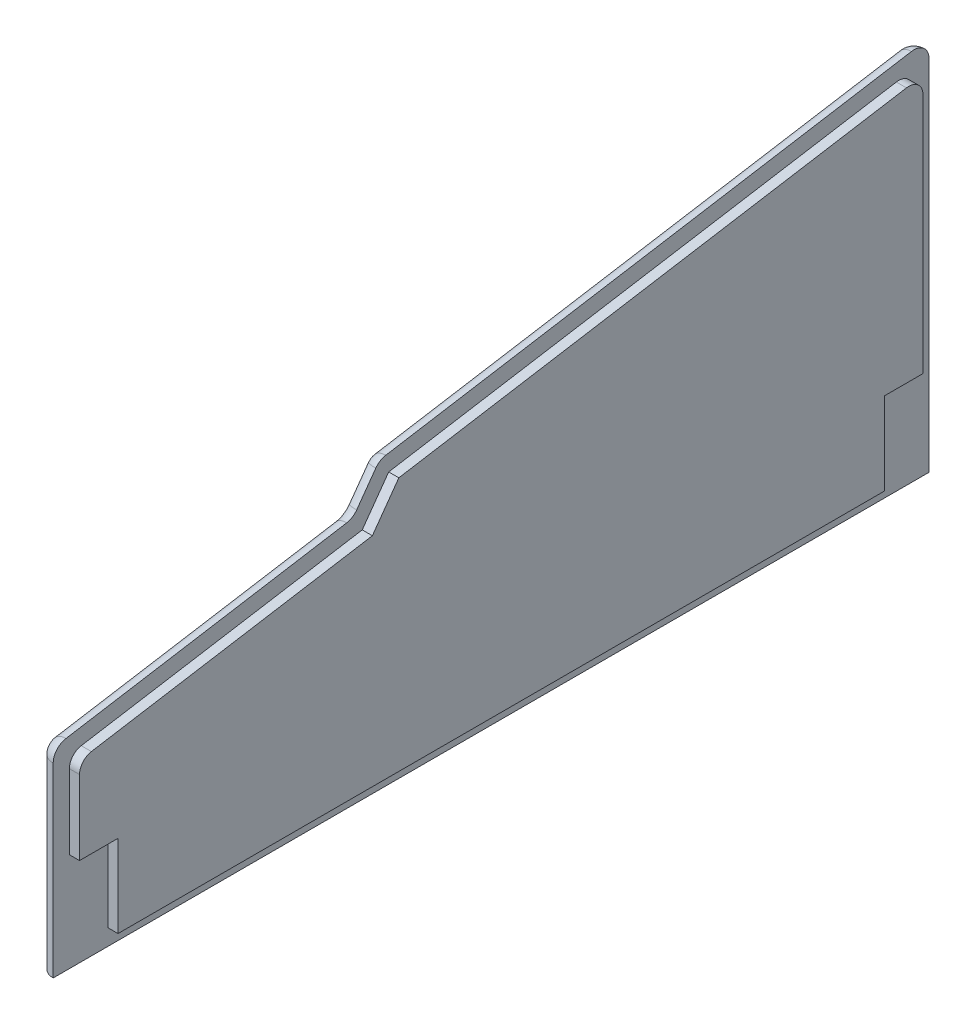
ISO-10303-21;
HEADER;
FILE_DESCRIPTION(('STEP AP214'),'2;1');
FILE_NAME('part.step','',(''),(''),'','','');
FILE_SCHEMA(('AUTOMOTIVE_DESIGN { 1 0 10303 214 1 1 1 1 }'));
ENDSEC;
DATA;
#1=APPLICATION_CONTEXT('core data for automotive mechanical design processes');
#2=APPLICATION_PROTOCOL_DEFINITION('international standard','automotive_design',2000,#1);
#3=PRODUCT_CONTEXT('',#1,'mechanical');
#4=PRODUCT('Part','Part','',(#3));
#5=PRODUCT_RELATED_PRODUCT_CATEGORY('part','',(#4));
#6=PRODUCT_DEFINITION_FORMATION('','',#4);
#7=PRODUCT_DEFINITION_CONTEXT('part definition',#1,'design');
#8=PRODUCT_DEFINITION('design','',#6,#7);
#9=PRODUCT_DEFINITION_SHAPE('','',#8);
#10=(LENGTH_UNIT() NAMED_UNIT(*) SI_UNIT(.MILLI.,.METRE.));
#11=(NAMED_UNIT(*) PLANE_ANGLE_UNIT() SI_UNIT($,.RADIAN.));
#12=(NAMED_UNIT(*) SI_UNIT($,.STERADIAN.) SOLID_ANGLE_UNIT());
#13=UNCERTAINTY_MEASURE_WITH_UNIT(LENGTH_MEASURE(1.E-05),#10,'distance_accuracy_value','');
#14=(GEOMETRIC_REPRESENTATION_CONTEXT(3) GLOBAL_UNCERTAINTY_ASSIGNED_CONTEXT((#13)) GLOBAL_UNIT_ASSIGNED_CONTEXT((#10,
#11,#12)) REPRESENTATION_CONTEXT('',''));
#15=CARTESIAN_POINT('',(0.,0.,0.));
#16=DIRECTION('',(0.,0.,1.));
#17=DIRECTION('',(1.,0.,0.));
#18=AXIS2_PLACEMENT_3D('',#15,#16,#17);
#19=CARTESIAN_POINT('',(-327.974562358316,0.,137.10500183886));
#20=DIRECTION('',(0.,0.,-1.));
#21=DIRECTION('',(-1.,0.,0.));
#22=AXIS2_PLACEMENT_3D('',#19,#20,#21);
#23=PLANE('',#22);
#24=DIRECTION('',(0.,-1.,0.));
#25=VECTOR('',#24,1.);
#26=CARTESIAN_POINT('',(-329.974562358316,0.,137.10500183886));
#27=LINE('',#26,#25);
#28=CARTESIAN_POINT('',(-329.974562358316,14.690261728625,137.10500183886));
#29=VERTEX_POINT('',#28);
#30=CARTESIAN_POINT('',(-329.974562358316,-0.0195091277780118,137.10500183886));
#31=VERTEX_POINT('',#30);
#32=EDGE_CURVE('E292',#29,#31,#27,.T.);
#33=ORIENTED_EDGE('',*,*,#32,.T.);
#34=DIRECTION('',(-1.,0.,0.));
#35=VECTOR('',#34,1.);
#36=CARTESIAN_POINT('',(-327.974562358316,-0.0195091277780118,137.10500183886));
#37=LINE('',#36,#35);
#38=CARTESIAN_POINT('',(-327.974562358316,-0.0195091277780118,137.10500183886));
#39=VERTEX_POINT('',#38);
#40=EDGE_CURVE('E232',#39,#31,#37,.T.);
#41=ORIENTED_EDGE('',*,*,#40,.F.);
#42=DIRECTION('',(0.,-1.,0.));
#43=VECTOR('',#42,1.);
#44=CARTESIAN_POINT('',(-327.974562358316,0.,137.10500183886));
#45=LINE('',#44,#43);
#46=CARTESIAN_POINT('',(-327.974562358316,14.690261728625,137.10500183886));
#47=VERTEX_POINT('',#46);
#48=EDGE_CURVE('E264',#47,#39,#45,.T.);
#49=ORIENTED_EDGE('',*,*,#48,.F.);
#50=DIRECTION('',(-1.,0.,0.));
#51=VECTOR('',#50,1.);
#52=CARTESIAN_POINT('',(-327.974562358316,14.690261728625,137.10500183886));
#53=LINE('',#52,#51);
#54=EDGE_CURVE('E233',#47,#29,#53,.T.);
#55=ORIENTED_EDGE('',*,*,#54,.T.);
#56=EDGE_LOOP('',(#33,#41,#49,#55));
#57=FACE_BOUND('',#56,.T.);
#58=ADVANCED_FACE('F40',(#57),#23,.F.);
#59=CARTESIAN_POINT('',(-327.974562358316,-0.0195091277779954,0.));
#60=DIRECTION('',(0.,-1.,0.));
#61=DIRECTION('',(0.,0.,-1.));
#62=AXIS2_PLACEMENT_3D('',#59,#60,#61);
#63=PLANE('',#62);
#64=DIRECTION('',(0.,0.,1.));
#65=VECTOR('',#64,1.);
#66=CARTESIAN_POINT('',(-329.974562358316,-0.0195091277779954,0.));
#67=LINE('',#66,#65);
#68=CARTESIAN_POINT('',(-329.974562358316,-0.0195091277780113,129.50500183886));
#69=VERTEX_POINT('',#68);
#70=EDGE_CURVE('E261',#69,#31,#67,.T.);
#71=ORIENTED_EDGE('',*,*,#70,.F.);
#72=DIRECTION('',(-1.,0.,0.));
#73=VECTOR('',#72,1.);
#74=CARTESIAN_POINT('',(-327.974562358316,-0.0195091277780113,129.50500183886));
#75=LINE('',#74,#73);
#76=CARTESIAN_POINT('',(-327.974562358316,-0.0195091277780113,129.50500183886));
#77=VERTEX_POINT('',#76);
#78=EDGE_CURVE('E257',#77,#69,#75,.T.);
#79=ORIENTED_EDGE('',*,*,#78,.F.);
#80=DIRECTION('',(0.,0.,1.));
#81=VECTOR('',#80,1.);
#82=CARTESIAN_POINT('',(-327.974562358316,-0.0195091277779954,0.));
#83=LINE('',#82,#81);
#84=EDGE_CURVE('E236',#77,#39,#83,.T.);
#85=ORIENTED_EDGE('',*,*,#84,.T.);
#86=ORIENTED_EDGE('',*,*,#40,.T.);
#87=EDGE_LOOP('',(#71,#79,#85,#86));
#88=FACE_BOUND('',#87,.T.);
#89=ADVANCED_FACE('F376',(#88),#63,.T.);
#90=CARTESIAN_POINT('',(-327.974562358316,2.20756218874649E-13,129.50500183886));
#91=DIRECTION('',(0.,0.,1.));
#92=DIRECTION('',(0.,-1.,0.));
#93=AXIS2_PLACEMENT_3D('',#90,#91,#92);
#94=PLANE('',#93);
#95=DIRECTION('',(0.,1.,0.));
#96=VECTOR('',#95,1.);
#97=CARTESIAN_POINT('',(-329.974562358316,2.20756218874649E-13,129.50500183886));
#98=LINE('',#97,#96);
#99=CARTESIAN_POINT('',(-329.974562358316,-16.3021121251671,129.50500183886));
#100=VERTEX_POINT('',#99);
#101=EDGE_CURVE('E265',#100,#69,#98,.T.);
#102=ORIENTED_EDGE('',*,*,#101,.F.);
#103=DIRECTION('',(-1.,0.,0.));
#104=VECTOR('',#103,1.);
#105=CARTESIAN_POINT('',(-327.974562358316,-16.3021121251671,129.50500183886));
#106=LINE('',#105,#104);
#107=CARTESIAN_POINT('',(-327.974562358316,-16.3021121251671,129.50500183886));
#108=VERTEX_POINT('',#107);
#109=EDGE_CURVE('E255',#108,#100,#106,.T.);
#110=ORIENTED_EDGE('',*,*,#109,.F.);
#111=DIRECTION('',(0.,1.,0.));
#112=VECTOR('',#111,1.);
#113=CARTESIAN_POINT('',(-327.974562358316,2.20756218874649E-13,129.50500183886));
#114=LINE('',#113,#112);
#115=EDGE_CURVE('E297',#108,#77,#114,.T.);
#116=ORIENTED_EDGE('',*,*,#115,.T.);
#117=ORIENTED_EDGE('',*,*,#78,.T.);
#118=EDGE_LOOP('',(#102,#110,#116,#117));
#119=FACE_BOUND('',#118,.T.);
#120=ADVANCED_FACE('F382',(#119),#94,.T.);
#121=CARTESIAN_POINT('',(-327.974562358316,-16.3021121251671,0.));
#122=DIRECTION('',(0.,-1.,0.));
#123=DIRECTION('',(0.,0.,-1.));
#124=AXIS2_PLACEMENT_3D('',#121,#122,#123);
#125=PLANE('',#124);
#126=DIRECTION('',(0.,0.,1.));
#127=VECTOR('',#126,1.);
#128=CARTESIAN_POINT('',(-329.974562358316,-16.3021121251671,0.));
#129=LINE('',#128,#127);
#130=CARTESIAN_POINT('',(-329.974562358316,-16.3021121251671,-21.8489705992885));
#131=VERTEX_POINT('',#130);
#132=EDGE_CURVE('E268',#131,#100,#129,.T.);
#133=ORIENTED_EDGE('',*,*,#132,.F.);
#134=DIRECTION('',(-1.,0.,0.));
#135=VECTOR('',#134,1.);
#136=CARTESIAN_POINT('',(-327.974562358316,-16.3021121251671,-21.8489705992885));
#137=LINE('',#136,#135);
#138=CARTESIAN_POINT('',(-327.974562358316,-16.3021121251671,-21.8489705992885));
#139=VERTEX_POINT('',#138);
#140=EDGE_CURVE('E253',#139,#131,#137,.T.);
#141=ORIENTED_EDGE('',*,*,#140,.F.);
#142=DIRECTION('',(0.,0.,1.));
#143=VECTOR('',#142,1.);
#144=CARTESIAN_POINT('',(-327.974562358316,-16.3021121251671,0.));
#145=LINE('',#144,#143);
#146=EDGE_CURVE('E300',#139,#108,#145,.T.);
#147=ORIENTED_EDGE('',*,*,#146,.T.);
#148=ORIENTED_EDGE('',*,*,#109,.T.);
#149=EDGE_LOOP('',(#133,#141,#147,#148));
#150=FACE_BOUND('',#149,.T.);
#151=ADVANCED_FACE('F555',(#150),#125,.T.);
#152=CARTESIAN_POINT('',(-327.974562358316,0.,-21.8489705992885));
#153=DIRECTION('',(0.,0.,-1.));
#154=DIRECTION('',(-1.,0.,0.));
#155=AXIS2_PLACEMENT_3D('',#152,#153,#154);
#156=PLANE('',#155);
#157=DIRECTION('',(0.,-1.,0.));
#158=VECTOR('',#157,1.);
#159=CARTESIAN_POINT('',(-329.974562358316,0.,-21.8489705992885));
#160=LINE('',#159,#158);
#161=CARTESIAN_POINT('',(-329.974562358316,-0.0195091277780118,-21.8489705992885));
#162=VERTEX_POINT('',#161);
#163=EDGE_CURVE('E271',#162,#131,#160,.T.);
#164=ORIENTED_EDGE('',*,*,#163,.F.);
#165=DIRECTION('',(-1.,0.,0.));
#166=VECTOR('',#165,1.);
#167=CARTESIAN_POINT('',(-327.974562358316,-0.0195091277780118,-21.8489705992885));
#168=LINE('',#167,#166);
#169=CARTESIAN_POINT('',(-327.974562358316,-0.0195091277780118,-21.8489705992885));
#170=VERTEX_POINT('',#169);
#171=EDGE_CURVE('E251',#170,#162,#168,.T.);
#172=ORIENTED_EDGE('',*,*,#171,.F.);
#173=DIRECTION('',(0.,-1.,0.));
#174=VECTOR('',#173,1.);
#175=CARTESIAN_POINT('',(-327.974562358316,0.,-21.8489705992885));
#176=LINE('',#175,#174);
#177=EDGE_CURVE('E303',#170,#139,#176,.T.);
#178=ORIENTED_EDGE('',*,*,#177,.T.);
#179=ORIENTED_EDGE('',*,*,#140,.T.);
#180=EDGE_LOOP('',(#164,#172,#178,#179));
#181=FACE_BOUND('',#180,.T.);
#182=ADVANCED_FACE('F544',(#181),#156,.T.);
#183=CARTESIAN_POINT('',(-327.974562358316,-0.0195091277780118,0.));
#184=DIRECTION('',(0.,1.,0.));
#185=DIRECTION('',(0.,0.,1.));
#186=AXIS2_PLACEMENT_3D('',#183,#184,#185);
#187=PLANE('',#186);
#188=DIRECTION('',(0.,0.,-1.));
#189=VECTOR('',#188,1.);
#190=CARTESIAN_POINT('',(-329.974562358316,-0.0195091277780118,0.));
#191=LINE('',#190,#189);
#192=CARTESIAN_POINT('',(-329.974562358316,-0.0195091277780118,-29.4489705992885));
#193=VERTEX_POINT('',#192);
#194=EDGE_CURVE('E274',#162,#193,#191,.T.);
#195=ORIENTED_EDGE('',*,*,#194,.T.);
#196=DIRECTION('',(-1.,0.,0.));
#197=VECTOR('',#196,1.);
#198=CARTESIAN_POINT('',(-327.974562358316,-0.0195091277780118,-29.4489705992885));
#199=LINE('',#198,#197);
#200=CARTESIAN_POINT('',(-327.974562358316,-0.0195091277780118,-29.4489705992885));
#201=VERTEX_POINT('',#200);
#202=EDGE_CURVE('E248',#201,#193,#199,.T.);
#203=ORIENTED_EDGE('',*,*,#202,.F.);
#204=DIRECTION('',(0.,0.,-1.));
#205=VECTOR('',#204,1.);
#206=CARTESIAN_POINT('',(-327.974562358316,-0.0195091277780118,0.));
#207=LINE('',#206,#205);
#208=EDGE_CURVE('E306',#170,#201,#207,.T.);
#209=ORIENTED_EDGE('',*,*,#208,.F.);
#210=ORIENTED_EDGE('',*,*,#171,.T.);
#211=EDGE_LOOP('',(#195,#203,#209,#210));
#212=FACE_BOUND('',#211,.T.);
#213=ADVANCED_FACE('F534',(#212),#187,.F.);
#214=CARTESIAN_POINT('',(-327.974562358316,0.,-29.4489705992885));
#215=DIRECTION('',(0.,0.,1.));
#216=DIRECTION('',(1.,0.,0.));
#217=AXIS2_PLACEMENT_3D('',#214,#215,#216);
#218=PLANE('',#217);
#219=DIRECTION('',(0.,1.,0.));
#220=VECTOR('',#219,1.);
#221=CARTESIAN_POINT('',(-329.974562358316,0.,-29.4489705992885));
#222=LINE('',#221,#220);
#223=CARTESIAN_POINT('',(-329.974562358316,47.708117707001,-29.4489705992885));
#224=VERTEX_POINT('',#223);
#225=EDGE_CURVE('E276',#193,#224,#222,.T.);
#226=ORIENTED_EDGE('',*,*,#225,.T.);
#227=DIRECTION('',(-1.,0.,0.));
#228=VECTOR('',#227,1.);
#229=CARTESIAN_POINT('',(-327.974562358316,47.708117707001,-29.4489705992885));
#230=LINE('',#229,#228);
#231=CARTESIAN_POINT('',(-327.974562358316,47.708117707001,-29.4489705992885));
#232=VERTEX_POINT('',#231);
#233=EDGE_CURVE('E246',#232,#224,#230,.T.);
#234=ORIENTED_EDGE('',*,*,#233,.F.);
#235=DIRECTION('',(0.,1.,0.));
#236=VECTOR('',#235,1.);
#237=CARTESIAN_POINT('',(-327.974562358316,0.,-29.4489705992885));
#238=LINE('',#237,#236);
#239=EDGE_CURVE('E308',#201,#232,#238,.T.);
#240=ORIENTED_EDGE('',*,*,#239,.F.);
#241=ORIENTED_EDGE('',*,*,#202,.T.);
#242=EDGE_LOOP('',(#226,#234,#240,#241));
#243=FACE_BOUND('',#242,.T.);
#244=ADVANCED_FACE('F524',(#243),#218,.F.);
#245=CARTESIAN_POINT('',(-327.974562358316,47.708117707001,-26.6489705992885));
#246=DIRECTION('',(-1.,0.,0.));
#247=DIRECTION('',(0.,0.,1.));
#248=AXIS2_PLACEMENT_3D('',#245,#246,#247);
#249=CYLINDRICAL_SURFACE('',#248,2.8);
#250=CARTESIAN_POINT('',(-329.974562358316,47.708117707001,-26.6489705992885));
#251=DIRECTION('',(-1.,0.,0.));
#252=DIRECTION('',(0.,0.,1.));
#253=AXIS2_PLACEMENT_3D('',#250,#251,#252);
#254=CIRCLE('',#253,2.8);
#255=CARTESIAN_POINT('',(-329.974562358316,50.4706843968319,-26.1926535119064));
#256=VERTEX_POINT('',#255);
#257=EDGE_CURVE('E279',#256,#224,#254,.T.);
#258=ORIENTED_EDGE('',*,*,#257,.F.);
#259=DIRECTION('',(-1.,0.,0.));
#260=VECTOR('',#259,1.);
#261=CARTESIAN_POINT('',(-327.974562358316,50.4706843968319,-26.1926535119064));
#262=LINE('',#261,#260);
#263=CARTESIAN_POINT('',(-327.974562358316,50.4706843968319,-26.1926535119064));
#264=VERTEX_POINT('',#263);
#265=EDGE_CURVE('E244',#264,#256,#262,.T.);
#266=ORIENTED_EDGE('',*,*,#265,.F.);
#267=CARTESIAN_POINT('',(-327.974562358316,47.708117707001,-26.6489705992885));
#268=DIRECTION('',(-1.,0.,0.));
#269=DIRECTION('',(0.,0.,1.));
#270=AXIS2_PLACEMENT_3D('',#267,#268,#269);
#271=CIRCLE('',#270,2.8);
#272=EDGE_CURVE('E310',#264,#232,#271,.T.);
#273=ORIENTED_EDGE('',*,*,#272,.T.);
#274=ORIENTED_EDGE('',*,*,#233,.T.);
#275=EDGE_LOOP('',(#258,#266,#273,#274));
#276=FACE_BOUND('',#275,.T.);
#277=ADVANCED_FACE('F514',(#276),#249,.T.);
#278=CARTESIAN_POINT('',(-327.974562358316,44.9186564788282,7.41960386657439));
#279=DIRECTION('',(0.,-0.98663096065388,-0.162970388350771));
#280=DIRECTION('',(0.,0.162970388350771,-0.98663096065388));
#281=AXIS2_PLACEMENT_3D('',#278,#279,#280);
#282=PLANE('',#281);
#283=DIRECTION('',(0.,-0.162970388350771,0.98663096065388));
#284=VECTOR('',#283,1.);
#285=CARTESIAN_POINT('',(-329.974562358316,44.9186564788282,7.41960386657439));
#286=LINE('',#285,#284);
#287=CARTESIAN_POINT('',(-329.974562358316,33.912543623929,74.0511668700437));
#288=VERTEX_POINT('',#287);
#289=EDGE_CURVE('E282',#256,#288,#286,.T.);
#290=ORIENTED_EDGE('',*,*,#289,.T.);
#291=DIRECTION('',(-1.,0.,0.));
#292=VECTOR('',#291,1.);
#293=CARTESIAN_POINT('',(-327.974562358316,33.912543623929,74.0511668700437));
#294=LINE('',#293,#292);
#295=CARTESIAN_POINT('',(-327.974562358316,33.912543623929,74.0511668700437));
#296=VERTEX_POINT('',#295);
#297=EDGE_CURVE('E241',#296,#288,#294,.T.);
#298=ORIENTED_EDGE('',*,*,#297,.F.);
#299=DIRECTION('',(0.,-0.162970388350771,0.98663096065388));
#300=VECTOR('',#299,1.);
#301=CARTESIAN_POINT('',(-327.974562358316,44.9186564788282,7.41960386657439));
#302=LINE('',#301,#300);
#303=EDGE_CURVE('E313',#264,#296,#302,.T.);
#304=ORIENTED_EDGE('',*,*,#303,.F.);
#305=ORIENTED_EDGE('',*,*,#265,.T.);
#306=EDGE_LOOP('',(#290,#298,#304,#305));
#307=FACE_BOUND('',#306,.T.);
#308=ADVANCED_FACE('F504',(#307),#282,.F.);
#309=CARTESIAN_POINT('',(-327.974562358316,46.5622513804118,64.9879681018858));
#310=DIRECTION('',(0.,-0.582415976071519,-0.812890909542394));
#311=DIRECTION('',(0.,0.812890909542394,-0.582415976071519));
#312=AXIS2_PLACEMENT_3D('',#309,#310,#311);
#313=PLANE('',#312);
#314=DIRECTION('',(0.,-0.812890909542394,0.582415976071519));
#315=VECTOR('',#314,1.);
#316=CARTESIAN_POINT('',(-329.974562358316,46.5622513804118,64.9879681018858));
#317=LINE('',#316,#315);
#318=CARTESIAN_POINT('',(-329.974562358316,26.6175096435601,79.2778759970325));
#319=VERTEX_POINT('',#318);
#320=EDGE_CURVE('E284',#288,#319,#317,.T.);
#321=ORIENTED_EDGE('',*,*,#320,.T.);
#322=DIRECTION('',(-1.,0.,0.));
#323=VECTOR('',#322,1.);
#324=CARTESIAN_POINT('',(-327.974562358316,26.6175096435601,79.2778759970325));
#325=LINE('',#324,#323);
#326=CARTESIAN_POINT('',(-327.974562358316,26.6175096435601,79.2778759970325));
#327=VERTEX_POINT('',#326);
#328=EDGE_CURVE('E238',#327,#319,#325,.T.);
#329=ORIENTED_EDGE('',*,*,#328,.F.);
#330=DIRECTION('',(0.,-0.812890909542394,0.582415976071519));
#331=VECTOR('',#330,1.);
#332=CARTESIAN_POINT('',(-327.974562358316,46.5622513804118,64.9879681018858));
#333=LINE('',#332,#331);
#334=EDGE_CURVE('E315',#296,#327,#333,.T.);
#335=ORIENTED_EDGE('',*,*,#334,.F.);
#336=ORIENTED_EDGE('',*,*,#297,.T.);
#337=EDGE_LOOP('',(#321,#329,#335,#336));
#338=FACE_BOUND('',#337,.T.);
#339=ADVANCED_FACE('F495',(#338),#313,.F.);
#340=CARTESIAN_POINT('',(-327.974562358316,38.6577849251494,6.38544143988436));
#341=DIRECTION('',(0.,-0.98663096065388,-0.162970388350771));
#342=DIRECTION('',(0.,0.162970388350771,-0.98663096065388));
#343=AXIS2_PLACEMENT_3D('',#340,#341,#342);
#344=PLANE('',#343);
#345=DIRECTION('',(0.,-0.162970388350772,0.98663096065388));
#346=VECTOR('',#345,1.);
#347=CARTESIAN_POINT('',(-329.974562358316,38.6577849251494,6.38544143988436));
#348=LINE('',#347,#346);
#349=CARTESIAN_POINT('',(-329.974562358316,17.4528284184559,134.761318926242));
#350=VERTEX_POINT('',#349);
#351=EDGE_CURVE('E286',#319,#350,#348,.T.);
#352=ORIENTED_EDGE('',*,*,#351,.T.);
#353=DIRECTION('',(-1.,0.,0.));
#354=VECTOR('',#353,1.);
#355=CARTESIAN_POINT('',(-327.974562358316,17.4528284184559,134.761318926242));
#356=LINE('',#355,#354);
#357=CARTESIAN_POINT('',(-327.974562358316,17.4528284184559,134.761318926242));
#358=VERTEX_POINT('',#357);
#359=EDGE_CURVE('E235',#358,#350,#356,.T.);
#360=ORIENTED_EDGE('',*,*,#359,.F.);
#361=DIRECTION('',(0.,-0.162970388350772,0.98663096065388));
#362=VECTOR('',#361,1.);
#363=CARTESIAN_POINT('',(-327.974562358316,38.6577849251494,6.38544143988436));
#364=LINE('',#363,#362);
#365=EDGE_CURVE('E317',#327,#358,#364,.T.);
#366=ORIENTED_EDGE('',*,*,#365,.F.);
#367=ORIENTED_EDGE('',*,*,#328,.T.);
#368=EDGE_LOOP('',(#352,#360,#366,#367));
#369=FACE_BOUND('',#368,.T.);
#370=ADVANCED_FACE('F486',(#369),#344,.F.);
#371=CARTESIAN_POINT('',(-327.974562358316,14.690261728625,134.30500183886));
#372=DIRECTION('',(-1.,0.,0.));
#373=DIRECTION('',(0.,0.,1.));
#374=AXIS2_PLACEMENT_3D('',#371,#372,#373);
#375=CYLINDRICAL_SURFACE('',#374,2.8);
#376=CARTESIAN_POINT('',(-329.974562358316,14.690261728625,134.30500183886));
#377=DIRECTION('',(-1.,0.,0.));
#378=DIRECTION('',(0.,0.,1.));
#379=AXIS2_PLACEMENT_3D('',#376,#377,#378);
#380=CIRCLE('',#379,2.8);
#381=EDGE_CURVE('E289',#29,#350,#380,.T.);
#382=ORIENTED_EDGE('',*,*,#381,.F.);
#383=ORIENTED_EDGE('',*,*,#54,.F.);
#384=CARTESIAN_POINT('',(-327.974562358316,14.690261728625,134.30500183886));
#385=DIRECTION('',(-1.,0.,0.));
#386=DIRECTION('',(0.,0.,1.));
#387=AXIS2_PLACEMENT_3D('',#384,#385,#386);
#388=CIRCLE('',#387,2.8);
#389=EDGE_CURVE('E319',#47,#358,#388,.T.);
#390=ORIENTED_EDGE('',*,*,#389,.T.);
#391=ORIENTED_EDGE('',*,*,#359,.T.);
#392=EDGE_LOOP('',(#382,#383,#390,#391));
#393=FACE_BOUND('',#392,.T.);
#394=ADVANCED_FACE('F387',(#393),#375,.T.);
#395=CARTESIAN_POINT('',(-327.974562358316,0.,0.));
#396=DIRECTION('',(-1.,0.,0.));
#397=DIRECTION('',(0.,0.,1.));
#398=AXIS2_PLACEMENT_3D('',#395,#396,#397);
#399=PLANE('',#398);
#400=ORIENTED_EDGE('',*,*,#48,.T.);
#401=ORIENTED_EDGE('',*,*,#84,.F.);
#402=ORIENTED_EDGE('',*,*,#115,.F.);
#403=ORIENTED_EDGE('',*,*,#146,.F.);
#404=ORIENTED_EDGE('',*,*,#177,.F.);
#405=ORIENTED_EDGE('',*,*,#208,.T.);
#406=ORIENTED_EDGE('',*,*,#239,.T.);
#407=ORIENTED_EDGE('',*,*,#272,.F.);
#408=ORIENTED_EDGE('',*,*,#303,.T.);
#409=ORIENTED_EDGE('',*,*,#334,.T.);
#410=ORIENTED_EDGE('',*,*,#365,.T.);
#411=ORIENTED_EDGE('',*,*,#389,.F.);
#412=EDGE_LOOP('',(#400,#401,#402,#403,#404,#405,#406,#407,#408,#409,#410,#411));
#413=FACE_BOUND('',#412,.T.);
#414=ADVANCED_FACE('F475',(#413),#399,.F.);
#415=CARTESIAN_POINT('',(-332.974562358316,-19.5021121251671,0.));
#416=DIRECTION('',(0.,1.,0.));
#417=DIRECTION('',(0.,0.,1.));
#418=AXIS2_PLACEMENT_3D('',#415,#416,#417);
#419=PLANE('',#418);
#420=DIRECTION('',(0.,0.,1.));
#421=VECTOR('',#420,1.);
#422=CARTESIAN_POINT('',(-332.974562358316,-19.5021121251671,0.));
#423=LINE('',#422,#421);
#424=CARTESIAN_POINT('',(-332.974562358316,-19.5021121251671,-29.6489705992885));
#425=VERTEX_POINT('',#424);
#426=CARTESIAN_POINT('',(-332.974562358316,-19.5021121251671,137.30500183886));
#427=VERTEX_POINT('',#426);
#428=EDGE_CURVE('E294',#425,#427,#423,.T.);
#429=ORIENTED_EDGE('',*,*,#428,.F.);
#430=CARTESIAN_POINT('',(-329.974562358316,-19.5021121251671,-29.6489705992885));
#431=DIRECTION('',(0.,1.,0.));
#432=DIRECTION('',(0.,0.,1.));
#433=AXIS2_PLACEMENT_3D('',#430,#431,#432);
#434=CIRCLE('',#433,3.);
#435=CARTESIAN_POINT('',(-329.974562358316,-19.5021121251671,-32.6489705992885));
#436=VERTEX_POINT('',#435);
#437=EDGE_CURVE('E11',#425,#436,#434,.F.);
#438=ORIENTED_EDGE('',*,*,#437,.T.);
#439=DIRECTION('',(0.,0.,1.));
#440=VECTOR('',#439,1.);
#441=CARTESIAN_POINT('',(-329.974562358316,-19.5021121251671,0.));
#442=LINE('',#441,#440);
#443=CARTESIAN_POINT('',(-329.974562358316,-19.5021121251671,140.30500183886));
#444=VERTEX_POINT('',#443);
#445=EDGE_CURVE('E323',#436,#444,#442,.T.);
#446=ORIENTED_EDGE('',*,*,#445,.T.);
#447=CARTESIAN_POINT('',(-329.974562358316,-19.5021121251671,137.30500183886));
#448=DIRECTION('',(0.,1.,0.));
#449=DIRECTION('',(0.,0.,1.));
#450=AXIS2_PLACEMENT_3D('',#447,#448,#449);
#451=CIRCLE('',#450,3.);
#452=EDGE_CURVE('E49',#444,#427,#451,.F.);
#453=ORIENTED_EDGE('',*,*,#452,.T.);
#454=EDGE_LOOP('',(#429,#438,#446,#453));
#455=FACE_BOUND('',#454,.T.);
#456=ADVANCED_FACE('F349',(#455),#419,.F.);
#457=CARTESIAN_POINT('',(-332.974562358316,0.,0.));
#458=DIRECTION('',(-1.,0.,0.));
#459=DIRECTION('',(0.,0.,1.));
#460=AXIS2_PLACEMENT_3D('',#457,#458,#459);
#461=PLANE('',#460);
#462=DIRECTION('',(0.,0.162970388350771,-0.98663096065388));
#463=VECTOR('',#462,1.);
#464=CARTESIAN_POINT('',(-332.974562358316,51.2443042896114,-29.6489705992885));
#465=LINE('',#464,#463);
#466=CARTESIAN_POINT('',(-332.974562358316,34.0963689070357,74.1654961327059));
#467=VERTEX_POINT('',#466);
#468=CARTESIAN_POINT('',(-332.974562358316,51.2443042896114,-29.6489705992885));
#469=VERTEX_POINT('',#468);
#470=EDGE_CURVE('E57',#467,#469,#465,.T.);
#471=ORIENTED_EDGE('',*,*,#470,.T.);
#472=DIRECTION('',(0.,-1.,0.));
#473=VECTOR('',#472,1.);
#474=CARTESIAN_POINT('',(-332.974562358316,-19.5021121251671,-29.6489705992885));
#475=LINE('',#474,#473);
#476=EDGE_CURVE('E222',#469,#425,#475,.T.);
#477=ORIENTED_EDGE('',*,*,#476,.T.);
#478=ORIENTED_EDGE('',*,*,#428,.T.);
#479=DIRECTION('',(0.,1.,0.));
#480=VECTOR('',#479,1.);
#481=CARTESIAN_POINT('',(-332.974562358316,17.2353763004235,137.30500183886));
#482=LINE('',#481,#480);
#483=CARTESIAN_POINT('',(-332.974562358316,17.2353763004235,137.30500183886));
#484=VERTEX_POINT('',#483);
#485=EDGE_CURVE('E230',#427,#484,#482,.T.);
#486=ORIENTED_EDGE('',*,*,#485,.T.);
#487=DIRECTION('',(0.,0.162970388350772,-0.98663096065388));
#488=VECTOR('',#487,1.);
#489=CARTESIAN_POINT('',(-332.974562358316,26.3963076559463,81.8442608094549));
#490=LINE('',#489,#488);
#491=CARTESIAN_POINT('',(-332.974562358316,26.3963076559463,81.8442608094548));
#492=VERTEX_POINT('',#491);
#493=EDGE_CURVE('E228',#484,#492,#490,.T.);
#494=ORIENTED_EDGE('',*,*,#493,.T.);
#495=CARTESIAN_POINT('',(-332.974562358316,32.3160934198696,82.8220831395595));
#496=DIRECTION('',(-1.,0.,0.));
#497=DIRECTION('',(0.,0.,1.));
#498=AXIS2_PLACEMENT_3D('',#495,#496,#497);
#499=CIRCLE('',#498,6.);
#500=CARTESIAN_POINT('',(-332.974562358316,28.8215975634404,77.9447376823051));
#501=VERTEX_POINT('',#500);
#502=EDGE_CURVE('E226',#492,#501,#499,.F.);
#503=ORIENTED_EDGE('',*,*,#502,.T.);
#504=DIRECTION('',(0.,0.812890909542392,-0.582415976071521));
#505=VECTOR('',#504,1.);
#506=CARTESIAN_POINT('',(-332.974562358316,34.0963689070357,74.1654961327059));
#507=LINE('',#506,#505);
#508=EDGE_CURVE('E62',#501,#467,#507,.T.);
#509=ORIENTED_EDGE('',*,*,#508,.T.);
#510=EDGE_LOOP('',(#471,#477,#478,#486,#494,#503,#509));
#511=FACE_BOUND('',#510,.T.);
#512=ADVANCED_FACE('F346',(#511),#461,.T.);
#513=CARTESIAN_POINT('',(-329.974562358316,0.,0.));
#514=DIRECTION('',(-1.,0.,0.));
#515=DIRECTION('',(0.,0.,1.));
#516=AXIS2_PLACEMENT_3D('',#513,#514,#515);
#517=PLANE('',#516);
#518=ORIENTED_EDGE('',*,*,#32,.F.);
#519=ORIENTED_EDGE('',*,*,#381,.T.);
#520=ORIENTED_EDGE('',*,*,#351,.F.);
#521=ORIENTED_EDGE('',*,*,#320,.F.);
#522=ORIENTED_EDGE('',*,*,#289,.F.);
#523=ORIENTED_EDGE('',*,*,#257,.T.);
#524=ORIENTED_EDGE('',*,*,#225,.F.);
#525=ORIENTED_EDGE('',*,*,#194,.F.);
#526=ORIENTED_EDGE('',*,*,#163,.T.);
#527=ORIENTED_EDGE('',*,*,#132,.T.);
#528=ORIENTED_EDGE('',*,*,#101,.T.);
#529=ORIENTED_EDGE('',*,*,#70,.T.);
#530=EDGE_LOOP('',(#518,#519,#520,#521,#522,#523,#524,#525,#526,#527,#528,#529));
#531=FACE_BOUND('',#530,.T.);
#532=DIRECTION('',(0.,1.,0.));
#533=VECTOR('',#532,1.);
#534=CARTESIAN_POINT('',(-329.974562358316,0.,140.30500183886));
#535=LINE('',#534,#533);
#536=CARTESIAN_POINT('',(-329.974562358316,17.2353763004235,140.30500183886));
#537=VERTEX_POINT('',#536);
#538=EDGE_CURVE('E185',#444,#537,#535,.T.);
#539=ORIENTED_EDGE('',*,*,#538,.F.);
#540=ORIENTED_EDGE('',*,*,#445,.F.);
#541=DIRECTION('',(0.,-1.,0.));
#542=VECTOR('',#541,1.);
#543=CARTESIAN_POINT('',(-329.974562358316,0.,-32.6489705992885));
#544=LINE('',#543,#542);
#545=CARTESIAN_POINT('',(-329.974562358316,51.2443042896114,-32.6489705992885));
#546=VERTEX_POINT('',#545);
#547=EDGE_CURVE('E325',#546,#436,#544,.T.);
#548=ORIENTED_EDGE('',*,*,#547,.F.);
#549=CARTESIAN_POINT('',(-329.974562358316,51.2443042896114,-29.6489705992885));
#550=DIRECTION('',(-1.,0.,0.));
#551=DIRECTION('',(0.,0.,1.));
#552=AXIS2_PLACEMENT_3D('',#549,#550,#551);
#553=CIRCLE('',#552,3.);
#554=CARTESIAN_POINT('',(-329.974562358316,54.2041971715731,-29.1600594342362));
#555=VERTEX_POINT('',#554);
#556=EDGE_CURVE('E328',#555,#546,#553,.T.);
#557=ORIENTED_EDGE('',*,*,#556,.F.);
#558=DIRECTION('',(0.,0.162970388350771,-0.98663096065388));
#559=VECTOR('',#558,1.);
#560=CARTESIAN_POINT('',(-329.974562358316,48.0758755529206,7.94110910929685));
#561=LINE('',#560,#559);
#562=CARTESIAN_POINT('',(-329.974562358316,37.0562617889974,74.6544072977582));
#563=VERTEX_POINT('',#562);
#564=EDGE_CURVE('E331',#563,#555,#561,.T.);
#565=ORIENTED_EDGE('',*,*,#564,.F.);
#566=CARTESIAN_POINT('',(-329.974562358316,34.0963689070357,74.1654961327059));
#567=DIRECTION('',(-1.,0.,0.));
#568=DIRECTION('',(0.,0.,1.));
#569=AXIS2_PLACEMENT_3D('',#566,#567,#568);
#570=CIRCLE('',#569,3.);
#571=CARTESIAN_POINT('',(-329.974562358316,35.8436168352503,76.6041688613331));
#572=VERTEX_POINT('',#571);
#573=EDGE_CURVE('E334',#572,#563,#570,.T.);
#574=ORIENTED_EDGE('',*,*,#573,.F.);
#575=DIRECTION('',(0.,0.812890909542392,-0.582415976071521));
#576=VECTOR('',#575,1.);
#577=CARTESIAN_POINT('',(-329.974562358316,48.4259825038408,67.5892190124213));
#578=LINE('',#577,#576);
#579=CARTESIAN_POINT('',(-329.974562358316,30.568845491655,80.3834104109323));
#580=VERTEX_POINT('',#579);
#581=EDGE_CURVE('E337',#580,#572,#578,.T.);
#582=ORIENTED_EDGE('',*,*,#581,.F.);
#583=CARTESIAN_POINT('',(-329.974562358316,32.3160934198696,82.8220831395595));
#584=DIRECTION('',(-1.,0.,0.));
#585=DIRECTION('',(0.,0.,1.));
#586=AXIS2_PLACEMENT_3D('',#583,#584,#585);
#587=CIRCLE('',#586,3.);
#588=CARTESIAN_POINT('',(-329.974562358316,29.3562005379079,82.3331719745072));
#589=VERTEX_POINT('',#588);
#590=EDGE_CURVE('E340',#589,#580,#587,.F.);
#591=ORIENTED_EDGE('',*,*,#590,.F.);
#592=DIRECTION('',(0.,0.162970388350772,-0.98663096065388));
#593=VECTOR('',#592,1.);
#594=CARTESIAN_POINT('',(-329.974562358316,41.8150039992419,6.90694668260686));
#595=LINE('',#594,#593);
#596=CARTESIAN_POINT('',(-329.974562358316,20.1952691823851,137.793913003912));
#597=VERTEX_POINT('',#596);
#598=EDGE_CURVE('E188',#597,#589,#595,.T.);
#599=ORIENTED_EDGE('',*,*,#598,.F.);
#600=CARTESIAN_POINT('',(-329.974562358316,17.2353763004235,137.30500183886));
#601=DIRECTION('',(-1.,0.,0.));
#602=DIRECTION('',(0.,0.,1.));
#603=AXIS2_PLACEMENT_3D('',#600,#601,#602);
#604=CIRCLE('',#603,3.);
#605=EDGE_CURVE('E181',#537,#597,#604,.T.);
#606=ORIENTED_EDGE('',*,*,#605,.F.);
#607=EDGE_LOOP('',(#539,#540,#548,#557,#565,#574,#582,#591,#599,#606));
#608=FACE_BOUND('',#607,.T.);
#609=ADVANCED_FACE('F183',(#531,#608),#517,.F.);
#610=CARTESIAN_POINT('',(-329.974562358316,0.,137.30500183886));
#611=DIRECTION('',(0.,-1.,0.));
#612=DIRECTION('',(0.,0.,-1.));
#613=AXIS2_PLACEMENT_3D('',#610,#611,#612);
#614=CYLINDRICAL_SURFACE('',#613,3.);
#615=ORIENTED_EDGE('',*,*,#452,.F.);
#616=ORIENTED_EDGE('',*,*,#538,.T.);
#617=CARTESIAN_POINT('',(-329.974562358316,17.2353763004235,137.30500183886));
#618=DIRECTION('',(0.,1.,0.));
#619=DIRECTION('',(0.,0.,1.));
#620=AXIS2_PLACEMENT_3D('',#617,#618,#619);
#621=CIRCLE('',#620,3.);
#622=EDGE_CURVE('E44',#484,#537,#621,.T.);
#623=ORIENTED_EDGE('',*,*,#622,.F.);
#624=ORIENTED_EDGE('',*,*,#485,.F.);
#625=EDGE_LOOP('',(#615,#616,#623,#624));
#626=FACE_BOUND('',#625,.T.);
#627=ADVANCED_FACE('F42',(#626),#614,.T.);
#628=CARTESIAN_POINT('',(-329.974562358316,17.2353763004235,137.30500183886));
#629=DIRECTION('',(-1.,0.,0.));
#630=DIRECTION('',(0.,0.,1.));
#631=AXIS2_PLACEMENT_3D('',#628,#629,#630);
#632=SPHERICAL_SURFACE('',#631,3.);
#633=ORIENTED_EDGE('',*,*,#622,.T.);
#634=ORIENTED_EDGE('',*,*,#605,.T.);
#635=CARTESIAN_POINT('',(-329.974562358316,17.2353763004235,137.30500183886));
#636=DIRECTION('',(0.,0.162970388350771,-0.98663096065388));
#637=DIRECTION('',(0.,0.98663096065388,0.162970388350771));
#638=AXIS2_PLACEMENT_3D('',#635,#636,#637);
#639=CIRCLE('',#638,3.);
#640=EDGE_CURVE('E199',#484,#597,#639,.T.);
#641=ORIENTED_EDGE('',*,*,#640,.F.);
#642=EDGE_LOOP('',(#633,#634,#641));
#643=FACE_BOUND('',#642,.T.);
#644=ADVANCED_FACE('F198',(#643),#632,.T.);
#645=CARTESIAN_POINT('',(-329.974562358316,38.8551111172802,6.41803551755454));
#646=DIRECTION('',(0.,-0.162970388350772,0.98663096065388));
#647=DIRECTION('',(0.,-0.98663096065388,-0.162970388350772));
#648=AXIS2_PLACEMENT_3D('',#645,#646,#647);
#649=CYLINDRICAL_SURFACE('',#648,3.);
#650=ORIENTED_EDGE('',*,*,#640,.T.);
#651=ORIENTED_EDGE('',*,*,#598,.T.);
#652=CARTESIAN_POINT('',(-329.974562358316,26.3963076559463,81.8442608094548));
#653=DIRECTION('',(0.,0.162970388350776,-0.98663096065388));
#654=DIRECTION('',(0.,0.98663096065388,0.162970388350776));
#655=AXIS2_PLACEMENT_3D('',#652,#653,#654);
#656=CIRCLE('',#655,3.);
#657=EDGE_CURVE('E201',#492,#589,#656,.T.);
#658=ORIENTED_EDGE('',*,*,#657,.F.);
#659=ORIENTED_EDGE('',*,*,#493,.F.);
#660=EDGE_LOOP('',(#650,#651,#658,#659));
#661=FACE_BOUND('',#660,.T.);
#662=ADVANCED_FACE('F367',(#661),#649,.T.);
#663=CARTESIAN_POINT('',(-329.974562358316,32.3160934198696,82.8220831395595));
#664=DIRECTION('',(-1.,0.,0.));
#665=DIRECTION('',(0.,0.,1.));
#666=AXIS2_PLACEMENT_3D('',#663,#664,#665);
#667=TOROIDAL_SURFACE('',#666,6.,3.);
#668=ORIENTED_EDGE('',*,*,#657,.T.);
#669=ORIENTED_EDGE('',*,*,#590,.T.);
#670=CARTESIAN_POINT('',(-329.974562358316,28.8215975634404,77.9447376823051));
#671=DIRECTION('',(0.,0.812890909542391,-0.582415976071522));
#672=DIRECTION('',(0.,0.582415976071522,0.812890909542391));
#673=AXIS2_PLACEMENT_3D('',#670,#671,#672);
#674=CIRCLE('',#673,3.);
#675=EDGE_CURVE('E204',#501,#580,#674,.T.);
#676=ORIENTED_EDGE('',*,*,#675,.F.);
#677=ORIENTED_EDGE('',*,*,#502,.F.);
#678=EDGE_LOOP('',(#668,#669,#676,#677));
#679=FACE_BOUND('',#678,.T.);
#680=ADVANCED_FACE('F365',(#679),#667,.T.);
#681=CARTESIAN_POINT('',(-329.974562358316,46.6787345756263,65.1505462837941));
#682=DIRECTION('',(0.,-0.812890909542392,0.582415976071521));
#683=DIRECTION('',(0.,-0.582415976071521,-0.812890909542392));
#684=AXIS2_PLACEMENT_3D('',#681,#682,#683);
#685=CYLINDRICAL_SURFACE('',#684,3.);
#686=ORIENTED_EDGE('',*,*,#675,.T.);
#687=ORIENTED_EDGE('',*,*,#581,.T.);
#688=CARTESIAN_POINT('',(-329.974562358316,34.0963689070357,74.1654961327059));
#689=DIRECTION('',(0.,0.812890909542391,-0.582415976071523));
#690=DIRECTION('',(0.,0.582415976071523,0.812890909542391));
#691=AXIS2_PLACEMENT_3D('',#688,#689,#690);
#692=CIRCLE('',#691,3.);
#693=EDGE_CURVE('E209',#467,#572,#692,.T.);
#694=ORIENTED_EDGE('',*,*,#693,.F.);
#695=ORIENTED_EDGE('',*,*,#508,.F.);
#696=EDGE_LOOP('',(#686,#687,#694,#695));
#697=FACE_BOUND('',#696,.T.);
#698=ADVANCED_FACE('F361',(#697),#685,.T.);
#699=CARTESIAN_POINT('',(-329.974562358316,34.0963689070357,74.1654961327059));
#700=DIRECTION('',(-1.,0.,0.));
#701=DIRECTION('',(0.,0.,1.));
#702=AXIS2_PLACEMENT_3D('',#699,#700,#701);
#703=SPHERICAL_SURFACE('',#702,3.);
#704=ORIENTED_EDGE('',*,*,#693,.T.);
#705=ORIENTED_EDGE('',*,*,#573,.T.);
#706=CARTESIAN_POINT('',(-329.974562358316,34.0963689070357,74.1654961327059));
#707=DIRECTION('',(0.,0.162970388350771,-0.98663096065388));
#708=DIRECTION('',(0.,0.98663096065388,0.162970388350771));
#709=AXIS2_PLACEMENT_3D('',#706,#707,#708);
#710=CIRCLE('',#709,3.);
#711=EDGE_CURVE('E212',#467,#563,#710,.T.);
#712=ORIENTED_EDGE('',*,*,#711,.F.);
#713=EDGE_LOOP('',(#704,#705,#712));
#714=FACE_BOUND('',#713,.T.);
#715=ADVANCED_FACE('F359',(#714),#703,.T.);
#716=CARTESIAN_POINT('',(-329.974562358316,45.115982670959,7.45219794424453));
#717=DIRECTION('',(0.,-0.162970388350771,0.98663096065388));
#718=DIRECTION('',(0.,-0.98663096065388,-0.162970388350771));
#719=AXIS2_PLACEMENT_3D('',#716,#717,#718);
#720=CYLINDRICAL_SURFACE('',#719,3.);
#721=ORIENTED_EDGE('',*,*,#711,.T.);
#722=ORIENTED_EDGE('',*,*,#564,.T.);
#723=CARTESIAN_POINT('',(-329.974562358316,51.2443042896114,-29.6489705992885));
#724=DIRECTION('',(0.,0.162970388350771,-0.98663096065388));
#725=DIRECTION('',(0.,0.98663096065388,0.162970388350771));
#726=AXIS2_PLACEMENT_3D('',#723,#724,#725);
#727=CIRCLE('',#726,3.);
#728=EDGE_CURVE('E215',#469,#555,#727,.T.);
#729=ORIENTED_EDGE('',*,*,#728,.F.);
#730=ORIENTED_EDGE('',*,*,#470,.F.);
#731=EDGE_LOOP('',(#721,#722,#729,#730));
#732=FACE_BOUND('',#731,.T.);
#733=ADVANCED_FACE('F356',(#732),#720,.T.);
#734=CARTESIAN_POINT('',(-329.974562358316,51.2443042896114,-29.6489705992885));
#735=DIRECTION('',(-1.,0.,0.));
#736=DIRECTION('',(0.,0.,1.));
#737=AXIS2_PLACEMENT_3D('',#734,#735,#736);
#738=SPHERICAL_SURFACE('',#737,3.);
#739=ORIENTED_EDGE('',*,*,#728,.T.);
#740=ORIENTED_EDGE('',*,*,#556,.T.);
#741=CARTESIAN_POINT('',(-329.974562358316,51.2443042896114,-29.6489705992885));
#742=DIRECTION('',(0.,-1.,0.));
#743=DIRECTION('',(0.,0.,-1.));
#744=AXIS2_PLACEMENT_3D('',#741,#742,#743);
#745=CIRCLE('',#744,3.);
#746=EDGE_CURVE('E218',#469,#546,#745,.T.);
#747=ORIENTED_EDGE('',*,*,#746,.F.);
#748=EDGE_LOOP('',(#739,#740,#747));
#749=FACE_BOUND('',#748,.T.);
#750=ADVANCED_FACE('F354',(#749),#738,.T.);
#751=CARTESIAN_POINT('',(-329.974562358316,0.,-29.6489705992885));
#752=DIRECTION('',(0.,1.,0.));
#753=DIRECTION('',(0.,0.,1.));
#754=AXIS2_PLACEMENT_3D('',#751,#752,#753);
#755=CYLINDRICAL_SURFACE('',#754,3.);
#756=ORIENTED_EDGE('',*,*,#746,.T.);
#757=ORIENTED_EDGE('',*,*,#547,.T.);
#758=ORIENTED_EDGE('',*,*,#437,.F.);
#759=ORIENTED_EDGE('',*,*,#476,.F.);
#760=EDGE_LOOP('',(#756,#757,#758,#759));
#761=FACE_BOUND('',#760,.T.);
#762=ADVANCED_FACE('F351',(#761),#755,.T.);
#763=CLOSED_SHELL('',(#58,#89,#120,#151,#182,#213,#244,#277,#308,#339,#370,#394,#414,#456,#512,
#609,#627,#644,#662,#680,#698,#715,#733,#750,#762));
#764=MANIFOLD_SOLID_BREP('B2',#763);
#765=ADVANCED_BREP_SHAPE_REPRESENTATION('',(#18,#764),#14);
#766=SHAPE_DEFINITION_REPRESENTATION(#9,#765);
ENDSEC;
END-ISO-10303-21;
